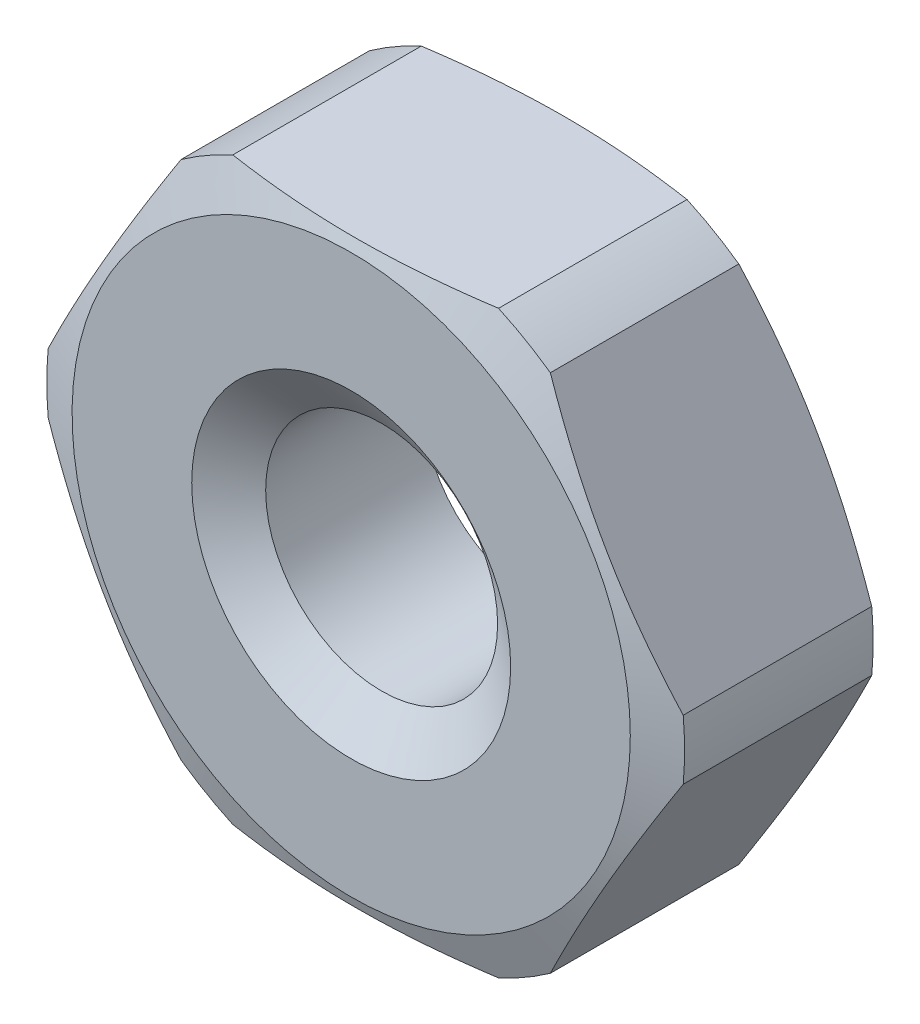
ISO-10303-21;
HEADER;
FILE_DESCRIPTION(('STEP AP214'),'2;1');
FILE_NAME('part.step','',(''),(''),'','','');
FILE_SCHEMA(('AUTOMOTIVE_DESIGN { 1 0 10303 214 1 1 1 1 }'));
ENDSEC;
DATA;
#1=APPLICATION_CONTEXT('core data for automotive mechanical design processes');
#2=APPLICATION_PROTOCOL_DEFINITION('international standard','automotive_design',2000,#1);
#3=PRODUCT_CONTEXT('',#1,'mechanical');
#4=PRODUCT('Part','Part','',(#3));
#5=PRODUCT_RELATED_PRODUCT_CATEGORY('part','',(#4));
#6=PRODUCT_DEFINITION_FORMATION('','',#4);
#7=PRODUCT_DEFINITION_CONTEXT('part definition',#1,'design');
#8=PRODUCT_DEFINITION('design','',#6,#7);
#9=PRODUCT_DEFINITION_SHAPE('','',#8);
#10=(LENGTH_UNIT() NAMED_UNIT(*) SI_UNIT(.MILLI.,.METRE.));
#11=(NAMED_UNIT(*) PLANE_ANGLE_UNIT() SI_UNIT($,.RADIAN.));
#12=(NAMED_UNIT(*) SI_UNIT($,.STERADIAN.) SOLID_ANGLE_UNIT());
#13=UNCERTAINTY_MEASURE_WITH_UNIT(LENGTH_MEASURE(1.E-05),#10,'distance_accuracy_value','');
#14=(GEOMETRIC_REPRESENTATION_CONTEXT(3) GLOBAL_UNCERTAINTY_ASSIGNED_CONTEXT((#13)) GLOBAL_UNIT_ASSIGNED_CONTEXT((#10,
#11,#12)) REPRESENTATION_CONTEXT('',''));
#15=CARTESIAN_POINT('',(0.,0.,0.));
#16=DIRECTION('',(0.,0.,1.));
#17=DIRECTION('',(1.,0.,0.));
#18=AXIS2_PLACEMENT_3D('',#15,#16,#17);
#19=CARTESIAN_POINT('',(2.3094010767585,0.,0.));
#20=DIRECTION('',(0.,0.,1.));
#21=DIRECTION('',(1.,0.,0.));
#22=AXIS2_PLACEMENT_3D('',#19,#20,#21);
#23=PLANE('',#22);
#24=CARTESIAN_POINT('',(0.,0.,0.));
#25=DIRECTION('',(0.,0.,1.));
#26=DIRECTION('',(1.,0.,0.));
#27=AXIS2_PLACEMENT_3D('',#24,#25,#26);
#28=CIRCLE('',#27,1.92525225805454);
#29=CARTESIAN_POINT('',(1.92525225805454,0.,0.));
#30=VERTEX_POINT('',#29);
#31=EDGE_CURVE('E140',#30,#30,#28,.T.);
#32=ORIENTED_EDGE('',*,*,#31,.F.);
#33=EDGE_LOOP('',(#32));
#34=FACE_BOUND('',#33,.T.);
#35=CARTESIAN_POINT('',(0.,0.,0.));
#36=DIRECTION('',(0.,0.,-1.));
#37=DIRECTION('',(-1.,0.,0.));
#38=AXIS2_PLACEMENT_3D('',#35,#36,#37);
#39=CIRCLE('',#38,1.1);
#40=CARTESIAN_POINT('',(-1.1,0.,0.));
#41=VERTEX_POINT('',#40);
#42=EDGE_CURVE('E366',#41,#41,#39,.T.);
#43=ORIENTED_EDGE('',*,*,#42,.F.);
#44=EDGE_LOOP('',(#43));
#45=FACE_BOUND('',#44,.T.);
#46=ADVANCED_FACE('F31',(#34,#45),#23,.F.);
#47=CARTESIAN_POINT('',(2.3094010767585,0.,1.5));
#48=DIRECTION('',(0.,0.,1.));
#49=DIRECTION('',(1.,0.,0.));
#50=AXIS2_PLACEMENT_3D('',#47,#48,#49);
#51=PLANE('',#50);
#52=CARTESIAN_POINT('',(0.,0.,1.5));
#53=DIRECTION('',(0.,0.,-1.));
#54=DIRECTION('',(-1.,0.,0.));
#55=AXIS2_PLACEMENT_3D('',#52,#53,#54);
#56=CIRCLE('',#55,1.1);
#57=CARTESIAN_POINT('',(-1.1,0.,1.5));
#58=VERTEX_POINT('',#57);
#59=EDGE_CURVE('E369',#58,#58,#56,.T.);
#60=ORIENTED_EDGE('',*,*,#59,.T.);
#61=EDGE_LOOP('',(#60));
#62=FACE_BOUND('',#61,.T.);
#63=CARTESIAN_POINT('',(0.,0.,1.5));
#64=DIRECTION('',(0.,0.,1.));
#65=DIRECTION('',(1.,0.,0.));
#66=AXIS2_PLACEMENT_3D('',#63,#64,#65);
#67=CIRCLE('',#66,1.92525225805454);
#68=CARTESIAN_POINT('',(1.92525225805454,0.,1.5));
#69=VERTEX_POINT('',#68);
#70=EDGE_CURVE('E298',#69,#69,#67,.T.);
#71=ORIENTED_EDGE('',*,*,#70,.T.);
#72=EDGE_LOOP('',(#71));
#73=FACE_BOUND('',#72,.T.);
#74=ADVANCED_FACE('F176',(#62,#73),#51,.T.);
#75=CARTESIAN_POINT('',(0.,0.,1.39999999999999));
#76=DIRECTION('',(0.,0.,-1.));
#77=DIRECTION('',(-1.,0.,0.));
#78=AXIS2_PLACEMENT_3D('',#75,#76,#77);
#79=CONICAL_SURFACE('',#78,2.2,1.22173047639603);
#80=ORIENTED_EDGE('',*,*,#70,.F.);
#81=EDGE_LOOP('',(#80));
#82=FACE_BOUND('',#81,.T.);
#83=CARTESIAN_POINT('',(0.,0.,1.39999999999999));
#84=DIRECTION('',(0.,0.,1.));
#85=DIRECTION('',(1.,0.,0.));
#86=AXIS2_PLACEMENT_3D('',#83,#84,#85);
#87=CIRCLE('',#86,2.2);
#88=CARTESIAN_POINT('',(2.19030837706446,-0.206274606680622,1.4));
#89=VERTEX_POINT('',#88);
#90=CARTESIAN_POINT('',(2.19030837706446,0.206274606680618,1.4));
#91=VERTEX_POINT('',#90);
#92=EDGE_CURVE('E291',#89,#91,#87,.T.);
#93=ORIENTED_EDGE('',*,*,#92,.T.);
#94=CARTESIAN_POINT('',(1.27313412611283,1.79486700872277,1.39979999999999));
#95=CARTESIAN_POINT('',(1.31120724031672,1.72892244051926,1.41136790775565));
#96=CARTESIAN_POINT('',(1.34937540350913,1.66281324263843,1.42176150053507));
#97=CARTESIAN_POINT('',(1.42588163140605,1.53030056882552,1.43989285981385));
#98=CARTESIAN_POINT('',(1.4642197503441,1.46389699895821,1.44762970583858));
#99=CARTESIAN_POINT('',(1.54077753705362,1.3312950226623,1.46009258218));
#100=CARTESIAN_POINT('',(1.57899643098598,1.26509795656237,1.4648372611018));
#101=CARTESIAN_POINT('',(1.655493826371,1.13260058110881,1.4711877350235));
#102=CARTESIAN_POINT('',(1.69377231696994,1.0663002905544,1.47279404685324));
#103=CARTESIAN_POINT('',(1.77032929816782,0.933699709445586,1.47279404685324));
#104=CARTESIAN_POINT('',(1.80860778876676,0.867399418891177,1.4711877350235));
#105=CARTESIAN_POINT('',(1.88510518415178,0.734902043437625,1.4648372611018));
#106=CARTESIAN_POINT('',(1.92332407808414,0.668704977337692,1.46009258218));
#107=CARTESIAN_POINT('',(1.99988186479366,0.536103001041784,1.44762970583858));
#108=CARTESIAN_POINT('',(2.03821998373171,0.469699431174473,1.43989285981385));
#109=CARTESIAN_POINT('',(2.11472621162863,0.337186757361557,1.42176150053507));
#110=CARTESIAN_POINT('',(2.15289437482104,0.27107755948073,1.41136790775565));
#111=CARTESIAN_POINT('',(2.19096748902493,0.205132991277222,1.39979999999999));
#112=B_SPLINE_CURVE_WITH_KNOTS('',3,(#94,#95,#96,#97,#98,#99,#100,#101,#102,#103,#104,#105,#106,
#107,#108,#109,#110,#111),.UNSPECIFIED.,.F.,.F.,(4,2,2,2,2,2,2,2,4),(0.,0.231067930980946,
0.462215838750475,0.691908503159181,0.921563338331183,1.15121817350319,1.38091083791189,
1.61205874568142,1.84312667666237),.UNSPECIFIED.);
#113=CARTESIAN_POINT('',(1.27379323807329,1.79372539331938,1.4));
#114=VERTEX_POINT('',#113);
#115=EDGE_CURVE('E144',#114,#91,#112,.T.);
#116=ORIENTED_EDGE('',*,*,#115,.F.);
#117=CARTESIAN_POINT('',(0.916515138991169,2.,1.4));
#118=VERTEX_POINT('',#117);
#119=EDGE_CURVE('E294',#114,#118,#87,.T.);
#120=ORIENTED_EDGE('',*,*,#119,.T.);
#121=CARTESIAN_POINT('',(-3.05086046002106,2.,0.872978805913067));
#122=CARTESIAN_POINT('',(-2.96044076369609,2.,0.900494650898357));
#123=CARTESIAN_POINT('',(-2.86992114336178,2.,0.927687446935066));
#124=CARTESIAN_POINT('',(-2.68863109350567,2.,0.98124966810779));
#125=CARTESIAN_POINT('',(-2.59786064461484,2.,1.00761902760764));
#126=CARTESIAN_POINT('',(-2.41586111316515,2.,1.05940138771184));
#127=CARTESIAN_POINT('',(-2.32463148879644,2.,1.084812493575));
#128=CARTESIAN_POINT('',(-2.14183232063757,2.,1.13437347920377));
#129=CARTESIAN_POINT('',(-2.05026278302809,2.,1.15852338178286));
#130=CARTESIAN_POINT('',(-1.77723674861193,2.,1.22806479485022));
#131=CARTESIAN_POINT('',(-1.59519644815989,2.,1.27120713012665));
#132=CARTESIAN_POINT('',(-1.22911103865221,2.,1.34804446629048));
#133=CARTESIAN_POINT('',(-1.04506683093803,2.,1.38174354599371));
#134=CARTESIAN_POINT('',(-0.77784161210773,2.,1.42015971058028));
#135=CARTESIAN_POINT('',(-0.695480506118094,2.,1.43057276432985));
#136=CARTESIAN_POINT('',(-0.530418770073626,2.,1.44817647128278));
#137=CARTESIAN_POINT('',(-0.447718183429914,2.,1.45536752429507));
#138=CARTESIAN_POINT('',(-0.282134823820284,2.,1.46618379095027));
#139=CARTESIAN_POINT('',(-0.199252204981956,2.,1.46981132874095));
#140=CARTESIAN_POINT('',(-0.0334067905615456,2.,1.47331612131326));
#141=CARTESIAN_POINT('',(0.0495560044834557,2.,1.47319340104523));
#142=CARTESIAN_POINT('',(0.215811166705981,2.,1.46919438299726));
#143=CARTESIAN_POINT('',(0.299103067788997,2.,1.46529902496381));
#144=CARTESIAN_POINT('',(0.465443456510323,2.,1.45393361857381));
#145=CARTESIAN_POINT('',(0.548491929253304,2.,1.44646335588143));
#146=CARTESIAN_POINT('',(0.714300897461116,2.,1.42829714883832));
#147=CARTESIAN_POINT('',(0.797061093180625,2.,1.41759850585961));
#148=CARTESIAN_POINT('',(0.96216633705195,2.,1.39340467671274));
#149=CARTESIAN_POINT('',(1.0445113830364,2.,1.37990947596011));
#150=CARTESIAN_POINT('',(1.29965645327958,2.,1.33433976001624));
#151=CARTESIAN_POINT('',(1.47173358204038,2.,1.2982290937255));
#152=CARTESIAN_POINT('',(1.81429246837837,2.,1.21908421395208));
#153=CARTESIAN_POINT('',(1.98477363113495,2.,1.17604751995159));
#154=CARTESIAN_POINT('',(2.32472625960565,2.,1.08535733334319));
#155=CARTESIAN_POINT('',(2.4941961469921,2.,1.03769798119126));
#156=CARTESIAN_POINT('',(2.83220763779872,2.,0.939320068623586));
#157=CARTESIAN_POINT('',(3.00074938315879,2.,0.888601991001371));
#158=CARTESIAN_POINT('',(3.33529511951086,2.,0.785628128958138));
#159=CARTESIAN_POINT('',(3.50130639847476,2.,0.733395913796432));
#160=CARTESIAN_POINT('',(3.83286273898616,2.,0.627450074900576));
#161=CARTESIAN_POINT('',(3.99840777786154,2.,0.573736380451101));
#162=CARTESIAN_POINT('',(4.328518853645,2.,0.465433480468787));
#163=CARTESIAN_POINT('',(4.49308622803321,2.,0.410848341331465));
#164=CARTESIAN_POINT('',(4.82193272662415,2.,0.300860378682732));
#165=CARTESIAN_POINT('',(4.98621187335797,2.,0.245457622592));
#166=CARTESIAN_POINT('',(5.15039256482991,2.,0.189768714929287));
#167=B_SPLINE_CURVE_WITH_KNOTS('',3,(#121,#122,#123,#124,#125,#126,#127,#128,#129,#130,#131,
#132,#133,#134,#135,#136,#137,#138,#139,#140,#141,#142,#143,#144,#145,#146,#147,#148,#149,#150,
#151,#152,#153,#154,#155,#156,#157,#158,#159,#160,#161,#162,#163,#164,#165,#166),.UNSPECIFIED.,
.F.,.F.,(4,2,2,2,2,2,2,2,2,2,2,2,2,2,2,2,2,2,2,2,2,2,4),(0.,0.283542771896225,0.567108087606227,
0.851207469582295,1.13530171080225,1.69641247199117,2.2572804982901,2.5062780634318,
2.75524472261075,3.00404889609812,3.25285141430022,3.50291753412182,3.75299864870457,
4.00328938984448,4.25358143632096,4.78080202215963,5.30821185101709,5.8362991698904,
6.36430335177526,6.88639687541628,7.40851536338069,7.9286645304301,8.44877104302701),.UNSPECIFIED.);
#168=CARTESIAN_POINT('',(-0.916515138991173,2.,1.39999999999999));
#169=VERTEX_POINT('',#168);
#170=EDGE_CURVE('E187',#169,#118,#167,.T.);
#171=ORIENTED_EDGE('',*,*,#170,.F.);
#172=CARTESIAN_POINT('',(-1.27379323807329,1.79372539331938,1.39999999999999));
#173=VERTEX_POINT('',#172);
#174=EDGE_CURVE('E299',#169,#173,#87,.T.);
#175=ORIENTED_EDGE('',*,*,#174,.T.);
#176=CARTESIAN_POINT('',(-2.1909674890249,0.205132991277269,1.39979999999999));
#177=CARTESIAN_POINT('',(-2.15289437482101,0.271077559480774,1.41136790775564));
#178=CARTESIAN_POINT('',(-2.11472621162861,0.337186757361598,1.42176150053507));
#179=CARTESIAN_POINT('',(-2.03821998373169,0.469699431174508,1.43989285981384));
#180=CARTESIAN_POINT('',(-1.99988186479365,0.536103001041816,1.44762970583858));
#181=CARTESIAN_POINT('',(-1.92332407808413,0.668704977337717,1.46009258218));
#182=CARTESIAN_POINT('',(-1.88510518415177,0.734902043437648,1.4648372611018));
#183=CARTESIAN_POINT('',(-1.80860778876675,0.867399418891193,1.4711877350235));
#184=CARTESIAN_POINT('',(-1.77032929816781,0.933699709445599,1.47279404685323));
#185=CARTESIAN_POINT('',(-1.69377231696994,1.06630029055441,1.47279404685323));
#186=CARTESIAN_POINT('',(-1.655493826371,1.13260058110882,1.4711877350235));
#187=CARTESIAN_POINT('',(-1.57899643098598,1.26509795656236,1.4648372611018));
#188=CARTESIAN_POINT('',(-1.54077753705362,1.33129502266229,1.46009258218));
#189=CARTESIAN_POINT('',(-1.46421975034411,1.46389699895819,1.44762970583858));
#190=CARTESIAN_POINT('',(-1.42588163140606,1.5303005688255,1.43989285981384));
#191=CARTESIAN_POINT('',(-1.34937540350914,1.66281324263841,1.42176150053507));
#192=CARTESIAN_POINT('',(-1.31120724031674,1.72892244051924,1.41136790775564));
#193=CARTESIAN_POINT('',(-1.27313412611285,1.79486700872274,1.39979999999999));
#194=B_SPLINE_CURVE_WITH_KNOTS('',3,(#176,#177,#178,#179,#180,#181,#182,#183,#184,#185,#186,
#187,#188,#189,#190,#191,#192,#193),.UNSPECIFIED.,.F.,.F.,(4,2,2,2,2,2,2,2,4),(0.,
0.231067930980935,0.462215838750453,0.691908503159148,0.921563338331139,1.15121817350313,
1.38091083791183,1.61205874568134,1.84312667666228),.UNSPECIFIED.);
#195=CARTESIAN_POINT('',(-2.19030837706447,0.206274606680619,1.39999999999999));
#196=VERTEX_POINT('',#195);
#197=EDGE_CURVE('E162',#196,#173,#194,.T.);
#198=ORIENTED_EDGE('',*,*,#197,.F.);
#199=CARTESIAN_POINT('',(-2.19030837706447,-0.206274606680623,1.39999999999999));
#200=VERTEX_POINT('',#199);
#201=EDGE_CURVE('E304',#196,#200,#87,.T.);
#202=ORIENTED_EDGE('',*,*,#201,.T.);
#203=CARTESIAN_POINT('',(-1.27313412611285,-1.79486700872274,1.39979999999999));
#204=CARTESIAN_POINT('',(-1.31120724031674,-1.72892244051924,1.41136790775564));
#205=CARTESIAN_POINT('',(-1.34937540350914,-1.66281324263841,1.42176150053507));
#206=CARTESIAN_POINT('',(-1.42588163140606,-1.5303005688255,1.43989285981384));
#207=CARTESIAN_POINT('',(-1.4642197503441,-1.4638969989582,1.44762970583858));
#208=CARTESIAN_POINT('',(-1.54077753705362,-1.33129502266229,1.46009258218));
#209=CARTESIAN_POINT('',(-1.57899643098598,-1.26509795656236,1.4648372611018));
#210=CARTESIAN_POINT('',(-1.655493826371,-1.13260058110882,1.4711877350235));
#211=CARTESIAN_POINT('',(-1.69377231696994,-1.06630029055441,1.47279404685323));
#212=CARTESIAN_POINT('',(-1.77032929816781,-0.933699709445599,1.47279404685323));
#213=CARTESIAN_POINT('',(-1.80860778876675,-0.867399418891193,1.4711877350235));
#214=CARTESIAN_POINT('',(-1.88510518415177,-0.734902043437648,1.4648372611018));
#215=CARTESIAN_POINT('',(-1.92332407808413,-0.668704977337717,1.46009258218));
#216=CARTESIAN_POINT('',(-1.99988186479365,-0.536103001041816,1.44762970583858));
#217=CARTESIAN_POINT('',(-2.03821998373169,-0.469699431174507,1.43989285981384));
#218=CARTESIAN_POINT('',(-2.11472621162861,-0.337186757361597,1.42176150053507));
#219=CARTESIAN_POINT('',(-2.15289437482101,-0.271077559480773,1.41136790775564));
#220=CARTESIAN_POINT('',(-2.1909674890249,-0.205132991277268,1.39979999999999));
#221=B_SPLINE_CURVE_WITH_KNOTS('',3,(#203,#204,#205,#206,#207,#208,#209,#210,#211,#212,#213,
#214,#215,#216,#217,#218,#219,#220),.UNSPECIFIED.,.F.,.F.,(4,2,2,2,2,2,2,2,4),(0.,
0.231067930980936,0.462215838750454,0.69190850315915,0.921563338331142,1.15121817350313,
1.38091083791183,1.61205874568135,1.84312667666228),.UNSPECIFIED.);
#222=CARTESIAN_POINT('',(-1.2737932380733,-1.79372539331938,1.39999999999999));
#223=VERTEX_POINT('',#222);
#224=EDGE_CURVE('E155',#223,#200,#221,.T.);
#225=ORIENTED_EDGE('',*,*,#224,.F.);
#226=CARTESIAN_POINT('',(-0.916515138991174,-2.,1.39999999999999));
#227=VERTEX_POINT('',#226);
#228=EDGE_CURVE('E295',#223,#227,#87,.T.);
#229=ORIENTED_EDGE('',*,*,#228,.T.);
#230=CARTESIAN_POINT('',(-3.05086046002106,-2.,0.872978805913068));
#231=CARTESIAN_POINT('',(-2.96044076369609,-2.,0.900494650898358));
#232=CARTESIAN_POINT('',(-2.86992114336178,-2.,0.927687446935066));
#233=CARTESIAN_POINT('',(-2.68863109350567,-2.,0.98124966810779));
#234=CARTESIAN_POINT('',(-2.59786064461484,-2.,1.00761902760764));
#235=CARTESIAN_POINT('',(-2.41586111316515,-2.,1.05940138771184));
#236=CARTESIAN_POINT('',(-2.32463148879644,-2.,1.084812493575));
#237=CARTESIAN_POINT('',(-2.14183232063757,-2.,1.13437347920377));
#238=CARTESIAN_POINT('',(-2.05026278302808,-2.,1.15852338178286));
#239=CARTESIAN_POINT('',(-1.77723674861193,-2.,1.22806479485022));
#240=CARTESIAN_POINT('',(-1.59519644815989,-2.,1.27120713012665));
#241=CARTESIAN_POINT('',(-1.22911103865221,-2.,1.34804446629048));
#242=CARTESIAN_POINT('',(-1.04506683093803,-2.,1.38174354599371));
#243=CARTESIAN_POINT('',(-0.77784161210773,-2.,1.42015971058028));
#244=CARTESIAN_POINT('',(-0.695480506118094,-2.,1.43057276432985));
#245=CARTESIAN_POINT('',(-0.530418770073626,-2.,1.44817647128278));
#246=CARTESIAN_POINT('',(-0.447718183429914,-2.,1.45536752429507));
#247=CARTESIAN_POINT('',(-0.282134823820284,-2.,1.46618379095027));
#248=CARTESIAN_POINT('',(-0.199252204981956,-2.,1.46981132874095));
#249=CARTESIAN_POINT('',(-0.0334067905615454,-2.,1.47331612131326));
#250=CARTESIAN_POINT('',(0.0495560044834558,-2.,1.47319340104523));
#251=CARTESIAN_POINT('',(0.215811166705981,-2.,1.46919438299726));
#252=CARTESIAN_POINT('',(0.299103067788997,-2.,1.46529902496381));
#253=CARTESIAN_POINT('',(0.465443456510323,-2.,1.45393361857381));
#254=CARTESIAN_POINT('',(0.548491929253305,-2.,1.44646335588143));
#255=CARTESIAN_POINT('',(0.714300897461117,-2.,1.42829714883832));
#256=CARTESIAN_POINT('',(0.797061093180625,-2.,1.41759850585961));
#257=CARTESIAN_POINT('',(0.962166337051951,-2.,1.39340467671274));
#258=CARTESIAN_POINT('',(1.04451138303641,-2.,1.37990947596011));
#259=CARTESIAN_POINT('',(1.29965645327958,-2.,1.33433976001624));
#260=CARTESIAN_POINT('',(1.47173358204038,-2.,1.2982290937255));
#261=CARTESIAN_POINT('',(1.81429246837837,-2.,1.21908421395208));
#262=CARTESIAN_POINT('',(1.98477363113495,-2.,1.17604751995159));
#263=CARTESIAN_POINT('',(2.32472625960565,-2.,1.08535733334319));
#264=CARTESIAN_POINT('',(2.49419614699211,-2.,1.03769798119126));
#265=CARTESIAN_POINT('',(2.83220763779873,-2.,0.939320068623585));
#266=CARTESIAN_POINT('',(3.00074938315879,-2.,0.88860199100137));
#267=CARTESIAN_POINT('',(3.33529511951086,-2.,0.785628128958137));
#268=CARTESIAN_POINT('',(3.50130639847477,-2.,0.733395913796431));
#269=CARTESIAN_POINT('',(3.83286273898617,-2.,0.627450074900576));
#270=CARTESIAN_POINT('',(3.99840777786154,-2.,0.5737363804511));
#271=CARTESIAN_POINT('',(4.328518853645,-2.,0.465433480468786));
#272=CARTESIAN_POINT('',(4.49308622803321,-2.,0.410848341331464));
#273=CARTESIAN_POINT('',(4.82193272662415,-2.,0.300860378682732));
#274=CARTESIAN_POINT('',(4.98621187335797,-2.,0.245457622592));
#275=CARTESIAN_POINT('',(5.15039256482992,-2.,0.189768714929287));
#276=B_SPLINE_CURVE_WITH_KNOTS('',3,(#230,#231,#232,#233,#234,#235,#236,#237,#238,#239,#240,
#241,#242,#243,#244,#245,#246,#247,#248,#249,#250,#251,#252,#253,#254,#255,#256,#257,#258,#259,
#260,#261,#262,#263,#264,#265,#266,#267,#268,#269,#270,#271,#272,#273,#274,#275),.UNSPECIFIED.,
.F.,.F.,(4,2,2,2,2,2,2,2,2,2,2,2,2,2,2,2,2,2,2,2,2,2,4),(0.,0.283542771896225,0.567108087606226,
0.851207469582295,1.13530171080225,1.69641247199117,2.2572804982901,2.5062780634318,
2.75524472261075,3.00404889609812,3.25285141430021,3.50291753412182,3.75299864870457,
4.00328938984448,4.25358143632096,4.78080202215963,5.30821185101709,5.8362991698904,
6.36430335177526,6.88639687541628,7.40851536338069,7.9286645304301,8.44877104302701),.UNSPECIFIED.);
#277=CARTESIAN_POINT('',(0.91651513899117,-2.,1.4));
#278=VERTEX_POINT('',#277);
#279=EDGE_CURVE('E11',#278,#227,#276,.F.);
#280=ORIENTED_EDGE('',*,*,#279,.F.);
#281=CARTESIAN_POINT('',(1.27379323807329,-1.79372539331938,1.4));
#282=VERTEX_POINT('',#281);
#283=EDGE_CURVE('E292',#278,#282,#87,.T.);
#284=ORIENTED_EDGE('',*,*,#283,.T.);
#285=CARTESIAN_POINT('',(2.19096748902493,-0.205132991277224,1.39979999999999));
#286=CARTESIAN_POINT('',(2.15289437482104,-0.271077559480732,1.41136790775565));
#287=CARTESIAN_POINT('',(2.11472621162863,-0.337186757361559,1.42176150053507));
#288=CARTESIAN_POINT('',(2.03821998373171,-0.469699431174475,1.43989285981385));
#289=CARTESIAN_POINT('',(1.99988186479366,-0.536103001041786,1.44762970583858));
#290=CARTESIAN_POINT('',(1.92332407808414,-0.668704977337693,1.46009258218));
#291=CARTESIAN_POINT('',(1.88510518415178,-0.734902043437627,1.4648372611018));
#292=CARTESIAN_POINT('',(1.80860778876676,-0.867399418891178,1.4711877350235));
#293=CARTESIAN_POINT('',(1.77032929816782,-0.933699709445587,1.47279404685324));
#294=CARTESIAN_POINT('',(1.69377231696994,-1.06630029055441,1.47279404685324));
#295=CARTESIAN_POINT('',(1.655493826371,-1.13260058110881,1.4711877350235));
#296=CARTESIAN_POINT('',(1.57899643098598,-1.26509795656237,1.4648372611018));
#297=CARTESIAN_POINT('',(1.54077753705362,-1.3312950226623,1.46009258218));
#298=CARTESIAN_POINT('',(1.4642197503441,-1.46389699895821,1.44762970583858));
#299=CARTESIAN_POINT('',(1.42588163140605,-1.53030056882552,1.43989285981385));
#300=CARTESIAN_POINT('',(1.34937540350913,-1.66281324263843,1.42176150053507));
#301=CARTESIAN_POINT('',(1.31120724031672,-1.72892244051926,1.41136790775565));
#302=CARTESIAN_POINT('',(1.27313412611284,-1.79486700872277,1.39979999999999));
#303=B_SPLINE_CURVE_WITH_KNOTS('',3,(#285,#286,#287,#288,#289,#290,#291,#292,#293,#294,#295,
#296,#297,#298,#299,#300,#301,#302),.UNSPECIFIED.,.F.,.F.,(4,2,2,2,2,2,2,2,4),(0.,
0.231067930980946,0.462215838750474,0.69190850315918,0.921563338331182,1.15121817350318,
1.38091083791189,1.61205874568142,1.84312667666236),.UNSPECIFIED.);
#304=EDGE_CURVE('E196',#89,#282,#303,.T.);
#305=ORIENTED_EDGE('',*,*,#304,.F.);
#306=EDGE_LOOP('',(#93,#116,#120,#171,#175,#198,#202,#225,#229,#280,#284,#305));
#307=FACE_BOUND('',#306,.T.);
#308=ADVANCED_FACE('F170',(#82,#307),#79,.T.);
#309=CARTESIAN_POINT('',(0.,0.,0.));
#310=DIRECTION('',(0.,0.,1.));
#311=DIRECTION('',(1.,0.,0.));
#312=AXIS2_PLACEMENT_3D('',#309,#310,#311);
#313=CYLINDRICAL_SURFACE('',#312,2.2);
#314=ORIENTED_EDGE('',*,*,#283,.F.);
#315=DIRECTION('',(0.,0.,1.));
#316=VECTOR('',#315,1.);
#317=CARTESIAN_POINT('',(0.916515138991171,-2.,0.));
#318=LINE('',#317,#316);
#319=CARTESIAN_POINT('',(0.916515138991168,-2.,0.0999999999999951));
#320=VERTEX_POINT('',#319);
#321=EDGE_CURVE('E283',#320,#278,#318,.T.);
#322=ORIENTED_EDGE('',*,*,#321,.F.);
#323=CARTESIAN_POINT('',(0.,0.,0.0999999999999949));
#324=DIRECTION('',(0.,0.,1.));
#325=DIRECTION('',(1.,0.,0.));
#326=AXIS2_PLACEMENT_3D('',#323,#324,#325);
#327=CIRCLE('',#326,2.2);
#328=CARTESIAN_POINT('',(1.27379323807329,-1.79372539331938,0.0999999999999978));
#329=VERTEX_POINT('',#328);
#330=EDGE_CURVE('E139',#320,#329,#327,.T.);
#331=ORIENTED_EDGE('',*,*,#330,.T.);
#332=DIRECTION('',(0.,0.,1.));
#333=VECTOR('',#332,1.);
#334=CARTESIAN_POINT('',(1.27379323807329,-1.79372539331938,0.));
#335=LINE('',#334,#333);
#336=EDGE_CURVE('E147',#282,#329,#335,.F.);
#337=ORIENTED_EDGE('',*,*,#336,.F.);
#338=EDGE_LOOP('',(#314,#322,#331,#337));
#339=FACE_BOUND('',#338,.T.);
#340=ADVANCED_FACE('F175',(#339),#313,.T.);
#341=CARTESIAN_POINT('',(2.19030837706446,-0.206274606680626,0.0999999999999998));
#342=VERTEX_POINT('',#341);
#343=CARTESIAN_POINT('',(2.19030837706446,0.206274606680624,0.1));
#344=VERTEX_POINT('',#343);
#345=EDGE_CURVE('E52',#342,#344,#327,.T.);
#346=ORIENTED_EDGE('',*,*,#345,.T.);
#347=DIRECTION('',(0.,0.,1.));
#348=VECTOR('',#347,1.);
#349=CARTESIAN_POINT('',(2.19030837706446,0.206274606680618,0.));
#350=LINE('',#349,#348);
#351=EDGE_CURVE('E134',#91,#344,#350,.F.);
#352=ORIENTED_EDGE('',*,*,#351,.F.);
#353=ORIENTED_EDGE('',*,*,#92,.F.);
#354=DIRECTION('',(0.,0.,1.));
#355=VECTOR('',#354,1.);
#356=CARTESIAN_POINT('',(2.19030837706446,-0.206274606680622,0.));
#357=LINE('',#356,#355);
#358=EDGE_CURVE('E137',#342,#89,#357,.T.);
#359=ORIENTED_EDGE('',*,*,#358,.F.);
#360=EDGE_LOOP('',(#346,#352,#353,#359));
#361=FACE_BOUND('',#360,.T.);
#362=ADVANCED_FACE('F132',(#361),#313,.T.);
#363=CARTESIAN_POINT('',(1.27379323807329,1.79372539331938,0.0999999999999976));
#364=VERTEX_POINT('',#363);
#365=CARTESIAN_POINT('',(0.916515138991165,2.,0.099999999999997));
#366=VERTEX_POINT('',#365);
#367=EDGE_CURVE('E58',#364,#366,#327,.T.);
#368=ORIENTED_EDGE('',*,*,#367,.T.);
#369=DIRECTION('',(0.,0.,1.));
#370=VECTOR('',#369,1.);
#371=CARTESIAN_POINT('',(0.91651513899117,2.,0.));
#372=LINE('',#371,#370);
#373=EDGE_CURVE('E149',#118,#366,#372,.F.);
#374=ORIENTED_EDGE('',*,*,#373,.F.);
#375=ORIENTED_EDGE('',*,*,#119,.F.);
#376=DIRECTION('',(0.,0.,1.));
#377=VECTOR('',#376,1.);
#378=CARTESIAN_POINT('',(1.27379323807329,1.79372539331938,0.));
#379=LINE('',#378,#377);
#380=EDGE_CURVE('E145',#364,#114,#379,.T.);
#381=ORIENTED_EDGE('',*,*,#380,.F.);
#382=EDGE_LOOP('',(#368,#374,#375,#381));
#383=FACE_BOUND('',#382,.T.);
#384=ADVANCED_FACE('F331',(#383),#313,.T.);
#385=CARTESIAN_POINT('',(-0.916515138991167,2.,0.0999999999999926));
#386=VERTEX_POINT('',#385);
#387=CARTESIAN_POINT('',(-1.27379323807329,1.79372539331938,0.0999999999999919));
#388=VERTEX_POINT('',#387);
#389=EDGE_CURVE('E296',#386,#388,#327,.T.);
#390=ORIENTED_EDGE('',*,*,#389,.T.);
#391=DIRECTION('',(0.,0.,1.));
#392=VECTOR('',#391,1.);
#393=CARTESIAN_POINT('',(-1.27379323807329,1.79372539331938,0.));
#394=LINE('',#393,#392);
#395=EDGE_CURVE('E323',#173,#388,#394,.F.);
#396=ORIENTED_EDGE('',*,*,#395,.F.);
#397=ORIENTED_EDGE('',*,*,#174,.F.);
#398=DIRECTION('',(0.,0.,1.));
#399=VECTOR('',#398,1.);
#400=CARTESIAN_POINT('',(-0.91651513899117,2.,0.));
#401=LINE('',#400,#399);
#402=EDGE_CURVE('E326',#386,#169,#401,.T.);
#403=ORIENTED_EDGE('',*,*,#402,.F.);
#404=EDGE_LOOP('',(#390,#396,#397,#403));
#405=FACE_BOUND('',#404,.T.);
#406=ADVANCED_FACE('F333',(#405),#313,.T.);
#407=CARTESIAN_POINT('',(-2.19030837706446,0.206274606680624,0.0999999999999898));
#408=VERTEX_POINT('',#407);
#409=CARTESIAN_POINT('',(-2.19030837706446,-0.206274606680624,0.0999999999999898));
#410=VERTEX_POINT('',#409);
#411=EDGE_CURVE('E354',#408,#410,#327,.T.);
#412=ORIENTED_EDGE('',*,*,#411,.T.);
#413=DIRECTION('',(0.,0.,1.));
#414=VECTOR('',#413,1.);
#415=CARTESIAN_POINT('',(-2.19030837706446,-0.206274606680623,0.));
#416=LINE('',#415,#414);
#417=EDGE_CURVE('E318',#200,#410,#416,.F.);
#418=ORIENTED_EDGE('',*,*,#417,.F.);
#419=ORIENTED_EDGE('',*,*,#201,.F.);
#420=DIRECTION('',(0.,0.,1.));
#421=VECTOR('',#420,1.);
#422=CARTESIAN_POINT('',(-2.19030837706446,0.206274606680619,0.));
#423=LINE('',#422,#421);
#424=EDGE_CURVE('E319',#408,#196,#423,.T.);
#425=ORIENTED_EDGE('',*,*,#424,.F.);
#426=EDGE_LOOP('',(#412,#418,#419,#425));
#427=FACE_BOUND('',#426,.T.);
#428=ADVANCED_FACE('F338',(#427),#313,.T.);
#429=CARTESIAN_POINT('',(-1.27379323807329,-1.79372539331938,0.0999999999999918));
#430=VERTEX_POINT('',#429);
#431=CARTESIAN_POINT('',(-0.916515138991168,-2.,0.0999999999999928));
#432=VERTEX_POINT('',#431);
#433=EDGE_CURVE('E355',#430,#432,#327,.T.);
#434=ORIENTED_EDGE('',*,*,#433,.T.);
#435=DIRECTION('',(0.,0.,1.));
#436=VECTOR('',#435,1.);
#437=CARTESIAN_POINT('',(-0.916515138991171,-2.,0.));
#438=LINE('',#437,#436);
#439=EDGE_CURVE('E45',#227,#432,#438,.F.);
#440=ORIENTED_EDGE('',*,*,#439,.F.);
#441=ORIENTED_EDGE('',*,*,#228,.F.);
#442=DIRECTION('',(0.,0.,1.));
#443=VECTOR('',#442,1.);
#444=CARTESIAN_POINT('',(-1.27379323807329,-1.79372539331938,0.));
#445=LINE('',#444,#443);
#446=EDGE_CURVE('E315',#430,#223,#445,.T.);
#447=ORIENTED_EDGE('',*,*,#446,.F.);
#448=EDGE_LOOP('',(#434,#440,#441,#447));
#449=FACE_BOUND('',#448,.T.);
#450=ADVANCED_FACE('F222',(#449),#313,.T.);
#451=CARTESIAN_POINT('',(0.,0.,0.));
#452=DIRECTION('',(0.,0.,1.));
#453=DIRECTION('',(1.,0.,0.));
#454=AXIS2_PLACEMENT_3D('',#451,#452,#453);
#455=CONICAL_SURFACE('',#454,1.92525225805454,1.22173047639603);
#456=ORIENTED_EDGE('',*,*,#31,.T.);
#457=EDGE_LOOP('',(#456));
#458=FACE_BOUND('',#457,.T.);
#459=ORIENTED_EDGE('',*,*,#330,.F.);
#460=CARTESIAN_POINT('',(-3.05086046002106,-2.,0.627021194086902));
#461=CARTESIAN_POINT('',(-2.96044076369609,-2.,0.599505349101613));
#462=CARTESIAN_POINT('',(-2.86992114336179,-2.,0.572312553064905));
#463=CARTESIAN_POINT('',(-2.68863109350567,-2.,0.518750331892183));
#464=CARTESIAN_POINT('',(-2.59786064461484,-2.,0.492380972392337));
#465=CARTESIAN_POINT('',(-2.41586111316515,-2.,0.440598612288134));
#466=CARTESIAN_POINT('',(-2.32463148879645,-2.,0.415187506424979));
#467=CARTESIAN_POINT('',(-2.14183232063757,-2.,0.365626520796203));
#468=CARTESIAN_POINT('',(-2.05026278302809,-2.,0.341476618217115));
#469=CARTESIAN_POINT('',(-1.77723674861193,-2.,0.271935205149764));
#470=CARTESIAN_POINT('',(-1.59519644815989,-2.,0.228792869873336));
#471=CARTESIAN_POINT('',(-1.22911103865221,-2.,0.151955533709503));
#472=CARTESIAN_POINT('',(-1.04506683093803,-2.,0.118256454006273));
#473=CARTESIAN_POINT('',(-0.777841612107729,-2.,0.0798402894197066));
#474=CARTESIAN_POINT('',(-0.695480506118092,-2.,0.0694272356701418));
#475=CARTESIAN_POINT('',(-0.53041877007362,-2.,0.0518235287172063));
#476=CARTESIAN_POINT('',(-0.447718183429907,-2.,0.044632475704923));
#477=CARTESIAN_POINT('',(-0.282134823820274,-2.,0.0338162090497202));
#478=CARTESIAN_POINT('',(-0.199252204981945,-2.,0.0301886712590426));
#479=CARTESIAN_POINT('',(-0.0334067905615318,-2.,0.0266838786867313));
#480=CARTESIAN_POINT('',(0.049556004483471,-2.,0.0268065989547593));
#481=CARTESIAN_POINT('',(0.215811166705999,-2.,0.0308056170027377));
#482=CARTESIAN_POINT('',(0.299103067789016,-2.,0.0347009750361796));
#483=CARTESIAN_POINT('',(0.465443456510345,-2.,0.0460663814261895));
#484=CARTESIAN_POINT('',(0.548491929253328,-2.,0.0535366441185703));
#485=CARTESIAN_POINT('',(0.714300897461142,-2.,0.071702851161675));
#486=CARTESIAN_POINT('',(0.797061093180652,-2.,0.0824014941403851));
#487=CARTESIAN_POINT('',(0.96216633705198,-2.,0.106595323287257));
#488=CARTESIAN_POINT('',(1.04451138303644,-2.,0.120090524039886));
#489=CARTESIAN_POINT('',(1.29965645327961,-2.,0.165660239983763));
#490=CARTESIAN_POINT('',(1.47173358204041,-2.,0.201770906274498));
#491=CARTESIAN_POINT('',(1.8142924683784,-2.,0.280915786047919));
#492=CARTESIAN_POINT('',(1.98477363113498,-2.,0.323952480048415));
#493=CARTESIAN_POINT('',(2.32472625960568,-2.,0.414642666656817));
#494=CARTESIAN_POINT('',(2.49419614699213,-2.,0.462302018808745));
#495=CARTESIAN_POINT('',(2.83220763779875,-2.,0.560679931376419));
#496=CARTESIAN_POINT('',(3.00074938315882,-2.,0.611398008998634));
#497=CARTESIAN_POINT('',(3.33529511951089,-2.,0.714371871041868));
#498=CARTESIAN_POINT('',(3.50130639847479,-2.,0.766604086203574));
#499=CARTESIAN_POINT('',(3.83286273898619,-2.,0.872549925099429));
#500=CARTESIAN_POINT('',(3.99840777786156,-2.,0.926263619548904));
#501=CARTESIAN_POINT('',(4.32851885364503,-2.,1.03456651953122));
#502=CARTESIAN_POINT('',(4.49308622803323,-2.,1.08915165866854));
#503=CARTESIAN_POINT('',(4.82193272662418,-2.,1.19913962131727));
#504=CARTESIAN_POINT('',(4.98621187335799,-2.,1.25454237740801));
#505=CARTESIAN_POINT('',(5.15039256482994,-2.,1.31023128507072));
#506=B_SPLINE_CURVE_WITH_KNOTS('',3,(#460,#461,#462,#463,#464,#465,#466,#467,#468,#469,#470,
#471,#472,#473,#474,#475,#476,#477,#478,#479,#480,#481,#482,#483,#484,#485,#486,#487,#488,#489,
#490,#491,#492,#493,#494,#495,#496,#497,#498,#499,#500,#501,#502,#503,#504,#505),.UNSPECIFIED.,
.F.,.F.,(4,2,2,2,2,2,2,2,2,2,2,2,2,2,2,2,2,2,2,2,2,2,4),(0.,0.283542771896225,0.567108087606226,
0.851207469582294,1.13530171080225,1.69641247199117,2.2572804982901,2.5062780634318,
2.75524472261076,3.00404889609813,3.25285141430023,3.50291753412184,3.75299864870459,
4.00328938984451,4.25358143632099,4.78080202215966,5.30821185101712,5.83629916989043,
6.36430335177529,6.88639687541631,7.40851536338072,7.92866453043013,8.44877104302703),.UNSPECIFIED.);
#507=EDGE_CURVE('E228',#432,#320,#506,.T.);
#508=ORIENTED_EDGE('',*,*,#507,.F.);
#509=ORIENTED_EDGE('',*,*,#433,.F.);
#510=CARTESIAN_POINT('',(-2.19096748902489,-0.20513299127728,0.10019999999999));
#511=CARTESIAN_POINT('',(-2.15289437482101,-0.271077559480783,0.0886320922443358));
#512=CARTESIAN_POINT('',(-2.1147262116286,-0.337186757361605,0.0782384994649152));
#513=CARTESIAN_POINT('',(-2.03821998373169,-0.469699431174512,0.0601071401861403));
#514=CARTESIAN_POINT('',(-1.99988186479364,-0.536103001041818,0.0523702941614071));
#515=CARTESIAN_POINT('',(-1.92332407808413,-0.668704977337716,0.0399074178199889));
#516=CARTESIAN_POINT('',(-1.88510518415177,-0.734902043437644,0.0351627388981869));
#517=CARTESIAN_POINT('',(-1.80860778876675,-0.867399418891186,0.028812264976486));
#518=CARTESIAN_POINT('',(-1.77032929816782,-0.93369970944559,0.0272059531467509));
#519=CARTESIAN_POINT('',(-1.69377231696995,-1.0663002905544,0.0272059531467508));
#520=CARTESIAN_POINT('',(-1.65549382637101,-1.1326005811088,0.0288122649764859));
#521=CARTESIAN_POINT('',(-1.57899643098599,-1.26509795656234,0.0351627388981867));
#522=CARTESIAN_POINT('',(-1.54077753705363,-1.33129502266227,0.0399074178199888));
#523=CARTESIAN_POINT('',(-1.46421975034412,-1.46389699895817,0.0523702941614069));
#524=CARTESIAN_POINT('',(-1.42588163140608,-1.53030056882548,0.06010714018614));
#525=CARTESIAN_POINT('',(-1.34937540350916,-1.66281324263838,0.078238499464915));
#526=CARTESIAN_POINT('',(-1.31120724031675,-1.72892244051921,0.0886320922443356));
#527=CARTESIAN_POINT('',(-1.27313412611287,-1.79486700872271,0.10019999999999));
#528=B_SPLINE_CURVE_WITH_KNOTS('',3,(#510,#511,#512,#513,#514,#515,#516,#517,#518,#519,#520,
#521,#522,#523,#524,#525,#526,#527),.UNSPECIFIED.,.F.,.F.,(4,2,2,2,2,2,2,2,4),(0.,
0.231067930980929,0.46221583875044,0.691908503159129,0.921563338331114,1.1512181735031,
1.38091083791179,1.6120587456813,1.84312667666223),.UNSPECIFIED.);
#529=EDGE_CURVE('E236',#410,#430,#528,.T.);
#530=ORIENTED_EDGE('',*,*,#529,.F.);
#531=ORIENTED_EDGE('',*,*,#411,.F.);
#532=CARTESIAN_POINT('',(-1.27313412611287,1.79486700872271,0.10019999999999));
#533=CARTESIAN_POINT('',(-1.31120724031676,1.7289224405192,0.0886320922443356));
#534=CARTESIAN_POINT('',(-1.34937540350916,1.66281324263838,0.0782384994649151));
#535=CARTESIAN_POINT('',(-1.42588163140608,1.53030056882548,0.0601071401861403));
#536=CARTESIAN_POINT('',(-1.46421975034412,1.46389699895817,0.0523702941614071));
#537=CARTESIAN_POINT('',(-1.54077753705363,1.33129502266227,0.039907417819989));
#538=CARTESIAN_POINT('',(-1.57899643098599,1.26509795656234,0.0351627388981868));
#539=CARTESIAN_POINT('',(-1.65549382637101,1.1326005811088,0.028812264976486));
#540=CARTESIAN_POINT('',(-1.69377231696995,1.0663002905544,0.027205953146751));
#541=CARTESIAN_POINT('',(-1.77032929816782,0.93369970944559,0.0272059531467511));
#542=CARTESIAN_POINT('',(-1.80860778876675,0.867399418891185,0.0288122649764861));
#543=CARTESIAN_POINT('',(-1.88510518415177,0.734902043437644,0.0351627388981869));
#544=CARTESIAN_POINT('',(-1.92332407808413,0.668704977337715,0.039907417819989));
#545=CARTESIAN_POINT('',(-1.99988186479364,0.536103001041818,0.0523702941614072));
#546=CARTESIAN_POINT('',(-2.03821998373169,0.469699431174511,0.0601071401861404));
#547=CARTESIAN_POINT('',(-2.1147262116286,0.337186757361605,0.0782384994649152));
#548=CARTESIAN_POINT('',(-2.15289437482101,0.271077559480783,0.0886320922443357));
#549=CARTESIAN_POINT('',(-2.19096748902489,0.20513299127728,0.10019999999999));
#550=B_SPLINE_CURVE_WITH_KNOTS('',3,(#532,#533,#534,#535,#536,#537,#538,#539,#540,#541,#542,
#543,#544,#545,#546,#547,#548,#549),.UNSPECIFIED.,.F.,.F.,(4,2,2,2,2,2,2,2,4),(0.,
0.231067930980928,0.46221583875044,0.691908503159129,0.921563338331114,1.1512181735031,
1.38091083791179,1.6120587456813,1.84312667666223),.UNSPECIFIED.);
#551=EDGE_CURVE('E242',#388,#408,#550,.T.);
#552=ORIENTED_EDGE('',*,*,#551,.F.);
#553=ORIENTED_EDGE('',*,*,#389,.F.);
#554=CARTESIAN_POINT('',(-3.05086046002106,2.,0.627021194086902));
#555=CARTESIAN_POINT('',(-2.96044076369609,2.,0.599505349101613));
#556=CARTESIAN_POINT('',(-2.86992114336179,2.,0.572312553064905));
#557=CARTESIAN_POINT('',(-2.68863109350568,2.,0.518750331892183));
#558=CARTESIAN_POINT('',(-2.59786064461484,2.,0.492380972392337));
#559=CARTESIAN_POINT('',(-2.41586111316515,2.,0.440598612288134));
#560=CARTESIAN_POINT('',(-2.32463148879645,2.,0.415187506424979));
#561=CARTESIAN_POINT('',(-2.14183232063757,2.,0.365626520796203));
#562=CARTESIAN_POINT('',(-2.05026278302809,2.,0.341476618217115));
#563=CARTESIAN_POINT('',(-1.77723674861193,2.,0.271935205149764));
#564=CARTESIAN_POINT('',(-1.59519644815989,2.,0.228792869873336));
#565=CARTESIAN_POINT('',(-1.22911103865221,2.,0.151955533709503));
#566=CARTESIAN_POINT('',(-1.04506683093803,2.,0.118256454006273));
#567=CARTESIAN_POINT('',(-0.777841612107729,2.,0.0798402894197067));
#568=CARTESIAN_POINT('',(-0.695480506118092,2.,0.0694272356701418));
#569=CARTESIAN_POINT('',(-0.53041877007362,2.,0.0518235287172064));
#570=CARTESIAN_POINT('',(-0.447718183429907,2.,0.0446324757049231));
#571=CARTESIAN_POINT('',(-0.282134823820275,2.,0.0338162090497205));
#572=CARTESIAN_POINT('',(-0.199252204981946,2.,0.0301886712590429));
#573=CARTESIAN_POINT('',(-0.0334067905615322,2.,0.0266838786867315));
#574=CARTESIAN_POINT('',(0.0495560044834706,2.,0.0268065989547594));
#575=CARTESIAN_POINT('',(0.215811166705999,2.,0.0308056170027377));
#576=CARTESIAN_POINT('',(0.299103067789016,2.,0.0347009750361797));
#577=CARTESIAN_POINT('',(0.465443456510345,2.,0.0460663814261896));
#578=CARTESIAN_POINT('',(0.548491929253328,2.,0.0535366441185705));
#579=CARTESIAN_POINT('',(0.714300897461142,2.,0.0717028511616752));
#580=CARTESIAN_POINT('',(0.797061093180652,2.,0.0824014941403853));
#581=CARTESIAN_POINT('',(0.96216633705198,2.,0.106595323287257));
#582=CARTESIAN_POINT('',(1.04451138303644,2.,0.120090524039886));
#583=CARTESIAN_POINT('',(1.29965645327961,2.,0.165660239983763));
#584=CARTESIAN_POINT('',(1.47173358204041,2.,0.201770906274498));
#585=CARTESIAN_POINT('',(1.8142924683784,2.,0.280915786047918));
#586=CARTESIAN_POINT('',(1.98477363113498,2.,0.323952480048415));
#587=CARTESIAN_POINT('',(2.32472625960568,2.,0.414642666656817));
#588=CARTESIAN_POINT('',(2.49419614699213,2.,0.462302018808745));
#589=CARTESIAN_POINT('',(2.83220763779875,2.,0.560679931376419));
#590=CARTESIAN_POINT('',(3.00074938315882,2.,0.611398008998634));
#591=CARTESIAN_POINT('',(3.33529511951089,2.,0.714371871041868));
#592=CARTESIAN_POINT('',(3.50130639847479,2.,0.766604086203574));
#593=CARTESIAN_POINT('',(3.83286273898619,2.,0.872549925099429));
#594=CARTESIAN_POINT('',(3.99840777786156,2.,0.926263619548904));
#595=CARTESIAN_POINT('',(4.32851885364503,2.,1.03456651953122));
#596=CARTESIAN_POINT('',(4.49308622803323,2.,1.08915165866854));
#597=CARTESIAN_POINT('',(4.82193272662418,2.,1.19913962131727));
#598=CARTESIAN_POINT('',(4.98621187335799,2.,1.25454237740801));
#599=CARTESIAN_POINT('',(5.15039256482994,2.,1.31023128507072));
#600=B_SPLINE_CURVE_WITH_KNOTS('',3,(#554,#555,#556,#557,#558,#559,#560,#561,#562,#563,#564,
#565,#566,#567,#568,#569,#570,#571,#572,#573,#574,#575,#576,#577,#578,#579,#580,#581,#582,#583,
#584,#585,#586,#587,#588,#589,#590,#591,#592,#593,#594,#595,#596,#597,#598,#599),.UNSPECIFIED.,
.F.,.F.,(4,2,2,2,2,2,2,2,2,2,2,2,2,2,2,2,2,2,2,2,2,2,4),(0.,0.283542771896225,0.567108087606226,
0.851207469582295,1.13530171080225,1.69641247199117,2.2572804982901,2.5062780634318,
2.75524472261076,3.00404889609813,3.25285141430023,3.50291753412184,3.75299864870459,
4.00328938984451,4.25358143632099,4.78080202215966,5.30821185101712,5.83629916989043,
6.36430335177529,6.88639687541631,7.40851536338072,7.92866453043013,8.44877104302703),.UNSPECIFIED.);
#601=EDGE_CURVE('E129',#366,#386,#600,.F.);
#602=ORIENTED_EDGE('',*,*,#601,.F.);
#603=ORIENTED_EDGE('',*,*,#367,.F.);
#604=CARTESIAN_POINT('',(2.19096748902486,0.205132991277338,0.10019999999999));
#605=CARTESIAN_POINT('',(2.15289437482098,0.271077559480837,0.0886320922443368));
#606=CARTESIAN_POINT('',(2.11472621162857,0.337186757361655,0.0782384994649172));
#607=CARTESIAN_POINT('',(2.03821998373166,0.469699431174554,0.0601071401861441));
#608=CARTESIAN_POINT('',(1.99988186479362,0.536103001041857,0.0523702941614117));
#609=CARTESIAN_POINT('',(1.92332407808411,0.668704977337747,0.0399074178199949));
#610=CARTESIAN_POINT('',(1.88510518415176,0.734902043437672,0.0351627388981934));
#611=CARTESIAN_POINT('',(1.80860778876674,0.867399418891205,0.0288122649764934));
#612=CARTESIAN_POINT('',(1.77032929816781,0.933699709445606,0.0272059531467586));
#613=CARTESIAN_POINT('',(1.69377231696994,1.06630029055441,0.0272059531467586));
#614=CARTESIAN_POINT('',(1.65549382637101,1.13260058110881,0.0288122649764934));
#615=CARTESIAN_POINT('',(1.57899643098599,1.26509795656234,0.0351627388981935));
#616=CARTESIAN_POINT('',(1.54077753705363,1.33129502266227,0.0399074178199951));
#617=CARTESIAN_POINT('',(1.46421975034413,1.46389699895816,0.052370294161412));
#618=CARTESIAN_POINT('',(1.42588163140609,1.53030056882546,0.0601071401861444));
#619=CARTESIAN_POINT('',(1.34937540350917,1.66281324263836,0.0782384994649175));
#620=CARTESIAN_POINT('',(1.31120724031677,1.72892244051918,0.0886320922443369));
#621=CARTESIAN_POINT('',(1.27313412611289,1.79486700872268,0.10019999999999));
#622=B_SPLINE_CURVE_WITH_KNOTS('',3,(#604,#605,#606,#607,#608,#609,#610,#611,#612,#613,#614,
#615,#616,#617,#618,#619,#620,#621),.UNSPECIFIED.,.F.,.F.,(4,2,2,2,2,2,2,2,4),(0.,
0.231067930980915,0.462215838750413,0.691908503159089,0.921563338331061,1.15121817350303,
1.38091083791171,1.61205874568121,1.84312667666212),.UNSPECIFIED.);
#623=EDGE_CURVE('E123',#344,#364,#622,.T.);
#624=ORIENTED_EDGE('',*,*,#623,.F.);
#625=ORIENTED_EDGE('',*,*,#345,.F.);
#626=CARTESIAN_POINT('',(1.27313412611289,-1.79486700872267,0.10019999999999));
#627=CARTESIAN_POINT('',(1.31120724031677,-1.72892244051918,0.0886320922443369));
#628=CARTESIAN_POINT('',(1.34937540350917,-1.66281324263836,0.0782384994649176));
#629=CARTESIAN_POINT('',(1.42588163140609,-1.53030056882546,0.0601071401861446));
#630=CARTESIAN_POINT('',(1.46421975034413,-1.46389699895816,0.0523702941614123));
#631=CARTESIAN_POINT('',(1.54077753705364,-1.33129502266227,0.0399074178199955));
#632=CARTESIAN_POINT('',(1.57899643098599,-1.26509795656234,0.0351627388981939));
#633=CARTESIAN_POINT('',(1.65549382637101,-1.13260058110881,0.0288122649764938));
#634=CARTESIAN_POINT('',(1.69377231696994,-1.06630029055441,0.027205953146759));
#635=CARTESIAN_POINT('',(1.77032929816781,-0.933699709445607,0.0272059531467589));
#636=CARTESIAN_POINT('',(1.80860778876674,-0.867399418891206,0.0288122649764937));
#637=CARTESIAN_POINT('',(1.88510518415176,-0.734902043437673,0.0351627388981937));
#638=CARTESIAN_POINT('',(1.92332407808411,-0.668704977337748,0.0399074178199952));
#639=CARTESIAN_POINT('',(1.99988186479362,-0.536103001041858,0.0523702941614119));
#640=CARTESIAN_POINT('',(2.03821998373166,-0.469699431174556,0.0601071401861442));
#641=CARTESIAN_POINT('',(2.11472621162857,-0.337186757361657,0.0782384994649172));
#642=CARTESIAN_POINT('',(2.15289437482098,-0.271077559480839,0.0886320922443367));
#643=CARTESIAN_POINT('',(2.19096748902486,-0.20513299127734,0.10019999999999));
#644=B_SPLINE_CURVE_WITH_KNOTS('',3,(#626,#627,#628,#629,#630,#631,#632,#633,#634,#635,#636,
#637,#638,#639,#640,#641,#642,#643),.UNSPECIFIED.,.F.,.F.,(4,2,2,2,2,2,2,2,4),(0.,
0.231067930980915,0.462215838750413,0.691908503159088,0.921563338331059,1.15121817350303,
1.38091083791171,1.6120587456812,1.84312667666212),.UNSPECIFIED.);
#645=EDGE_CURVE('E128',#329,#342,#644,.T.);
#646=ORIENTED_EDGE('',*,*,#645,.F.);
#647=EDGE_LOOP('',(#459,#508,#509,#530,#531,#552,#553,#602,#603,#624,#625,#646));
#648=FACE_BOUND('',#647,.T.);
#649=ADVANCED_FACE('F124',(#458,#648),#455,.T.);
#650=CARTESIAN_POINT('',(-2.3094010767585,0.,1.5));
#651=DIRECTION('',(0.866025403784439,0.5,0.));
#652=DIRECTION('',(-0.5,0.866025403784439,0.));
#653=AXIS2_PLACEMENT_3D('',#650,#651,#652);
#654=PLANE('',#653);
#655=ORIENTED_EDGE('',*,*,#446,.T.);
#656=ORIENTED_EDGE('',*,*,#224,.T.);
#657=ORIENTED_EDGE('',*,*,#417,.T.);
#658=ORIENTED_EDGE('',*,*,#529,.T.);
#659=EDGE_LOOP('',(#655,#656,#657,#658));
#660=FACE_BOUND('',#659,.T.);
#661=ADVANCED_FACE('F168',(#660),#654,.F.);
#662=CARTESIAN_POINT('',(-1.15470053837925,2.,1.5));
#663=DIRECTION('',(0.866025403784439,-0.5,0.));
#664=DIRECTION('',(0.5,0.866025403784439,0.));
#665=AXIS2_PLACEMENT_3D('',#662,#663,#664);
#666=PLANE('',#665);
#667=ORIENTED_EDGE('',*,*,#424,.T.);
#668=ORIENTED_EDGE('',*,*,#197,.T.);
#669=ORIENTED_EDGE('',*,*,#395,.T.);
#670=ORIENTED_EDGE('',*,*,#551,.T.);
#671=EDGE_LOOP('',(#667,#668,#669,#670));
#672=FACE_BOUND('',#671,.T.);
#673=ADVANCED_FACE('F247',(#672),#666,.F.);
#674=CARTESIAN_POINT('',(1.15470053837925,2.,1.5));
#675=DIRECTION('',(0.,-1.,0.));
#676=DIRECTION('',(1.,0.,0.));
#677=AXIS2_PLACEMENT_3D('',#674,#675,#676);
#678=PLANE('',#677);
#679=ORIENTED_EDGE('',*,*,#402,.T.);
#680=ORIENTED_EDGE('',*,*,#170,.T.);
#681=ORIENTED_EDGE('',*,*,#373,.T.);
#682=ORIENTED_EDGE('',*,*,#601,.T.);
#683=EDGE_LOOP('',(#679,#680,#681,#682));
#684=FACE_BOUND('',#683,.T.);
#685=ADVANCED_FACE('F203',(#684),#678,.F.);
#686=CARTESIAN_POINT('',(2.3094010767585,0.,1.5));
#687=DIRECTION('',(-0.866025403784439,-0.5,0.));
#688=DIRECTION('',(0.5,-0.866025403784439,0.));
#689=AXIS2_PLACEMENT_3D('',#686,#687,#688);
#690=PLANE('',#689);
#691=ORIENTED_EDGE('',*,*,#380,.T.);
#692=ORIENTED_EDGE('',*,*,#115,.T.);
#693=ORIENTED_EDGE('',*,*,#351,.T.);
#694=ORIENTED_EDGE('',*,*,#623,.T.);
#695=EDGE_LOOP('',(#691,#692,#693,#694));
#696=FACE_BOUND('',#695,.T.);
#697=ADVANCED_FACE('F143',(#696),#690,.F.);
#698=CARTESIAN_POINT('',(1.15470053837925,-2.,1.5));
#699=DIRECTION('',(-0.866025403784439,0.5,0.));
#700=DIRECTION('',(-0.5,-0.866025403784439,0.));
#701=AXIS2_PLACEMENT_3D('',#698,#699,#700);
#702=PLANE('',#701);
#703=ORIENTED_EDGE('',*,*,#358,.T.);
#704=ORIENTED_EDGE('',*,*,#304,.T.);
#705=ORIENTED_EDGE('',*,*,#336,.T.);
#706=ORIENTED_EDGE('',*,*,#645,.T.);
#707=EDGE_LOOP('',(#703,#704,#705,#706));
#708=FACE_BOUND('',#707,.T.);
#709=ADVANCED_FACE('F33',(#708),#702,.F.);
#710=CARTESIAN_POINT('',(-1.15470053837925,-2.,1.5));
#711=DIRECTION('',(0.,1.,0.));
#712=DIRECTION('',(0.,0.,1.));
#713=AXIS2_PLACEMENT_3D('',#710,#711,#712);
#714=PLANE('',#713);
#715=ORIENTED_EDGE('',*,*,#321,.T.);
#716=ORIENTED_EDGE('',*,*,#279,.T.);
#717=ORIENTED_EDGE('',*,*,#439,.T.);
#718=ORIENTED_EDGE('',*,*,#507,.T.);
#719=EDGE_LOOP('',(#715,#716,#717,#718));
#720=FACE_BOUND('',#719,.T.);
#721=ADVANCED_FACE('F268',(#720),#714,.F.);
#722=CARTESIAN_POINT('',(0.,0.,0.));
#723=DIRECTION('',(0.,0.,-1.));
#724=DIRECTION('',(-1.,0.,0.));
#725=AXIS2_PLACEMENT_3D('',#722,#723,#724);
#726=CONICAL_SURFACE('',#725,1.1,0.959931088596884);
#727=CARTESIAN_POINT('',(0.,0.,0.210062261462913));
#728=DIRECTION('',(0.,0.,-1.));
#729=DIRECTION('',(-1.,0.,0.));
#730=AXIS2_PLACEMENT_3D('',#727,#728,#729);
#731=CIRCLE('',#730,0.799999999999999);
#732=CARTESIAN_POINT('',(-0.799999999999999,0.,0.210062261462913));
#733=VERTEX_POINT('',#732);
#734=EDGE_CURVE('E363',#733,#733,#731,.T.);
#735=ORIENTED_EDGE('',*,*,#734,.F.);
#736=EDGE_LOOP('',(#735));
#737=FACE_BOUND('',#736,.T.);
#738=ORIENTED_EDGE('',*,*,#42,.T.);
#739=EDGE_LOOP('',(#738));
#740=FACE_BOUND('',#739,.T.);
#741=ADVANCED_FACE('F271',(#737,#740),#726,.F.);
#742=CARTESIAN_POINT('',(0.,0.,1.28993773853709));
#743=DIRECTION('',(0.,0.,1.));
#744=DIRECTION('',(1.,0.,0.));
#745=AXIS2_PLACEMENT_3D('',#742,#743,#744);
#746=CONICAL_SURFACE('',#745,0.8,0.95993108859688);
#747=ORIENTED_EDGE('',*,*,#59,.F.);
#748=EDGE_LOOP('',(#747));
#749=FACE_BOUND('',#748,.T.);
#750=CARTESIAN_POINT('',(0.,0.,1.28993773853709));
#751=DIRECTION('',(0.,0.,-1.));
#752=DIRECTION('',(-1.,0.,0.));
#753=AXIS2_PLACEMENT_3D('',#750,#751,#752);
#754=CIRCLE('',#753,0.8);
#755=CARTESIAN_POINT('',(-0.8,0.,1.28993773853709));
#756=VERTEX_POINT('',#755);
#757=EDGE_CURVE('E360',#756,#756,#754,.T.);
#758=ORIENTED_EDGE('',*,*,#757,.T.);
#759=EDGE_LOOP('',(#758));
#760=FACE_BOUND('',#759,.T.);
#761=ADVANCED_FACE('F224',(#749,#760),#746,.F.);
#762=CARTESIAN_POINT('',(0.,0.,1.5));
#763=DIRECTION('',(0.,0.,-1.));
#764=DIRECTION('',(-1.,0.,0.));
#765=AXIS2_PLACEMENT_3D('',#762,#763,#764);
#766=CYLINDRICAL_SURFACE('',#765,0.8);
#767=ORIENTED_EDGE('',*,*,#757,.F.);
#768=EDGE_LOOP('',(#767));
#769=FACE_BOUND('',#768,.T.);
#770=ORIENTED_EDGE('',*,*,#734,.T.);
#771=EDGE_LOOP('',(#770));
#772=FACE_BOUND('',#771,.T.);
#773=ADVANCED_FACE('F179',(#769,#772),#766,.F.);
#774=CLOSED_SHELL('',(#46,#74,#308,#340,#362,#384,#406,#428,#450,#649,#661,#673,#685,#697,#709,
#721,#741,#761,#773));
#775=MANIFOLD_SOLID_BREP('B2',#774);
#776=ADVANCED_BREP_SHAPE_REPRESENTATION('',(#18,#775),#14);
#777=SHAPE_DEFINITION_REPRESENTATION(#9,#776);
ENDSEC;
END-ISO-10303-21;
